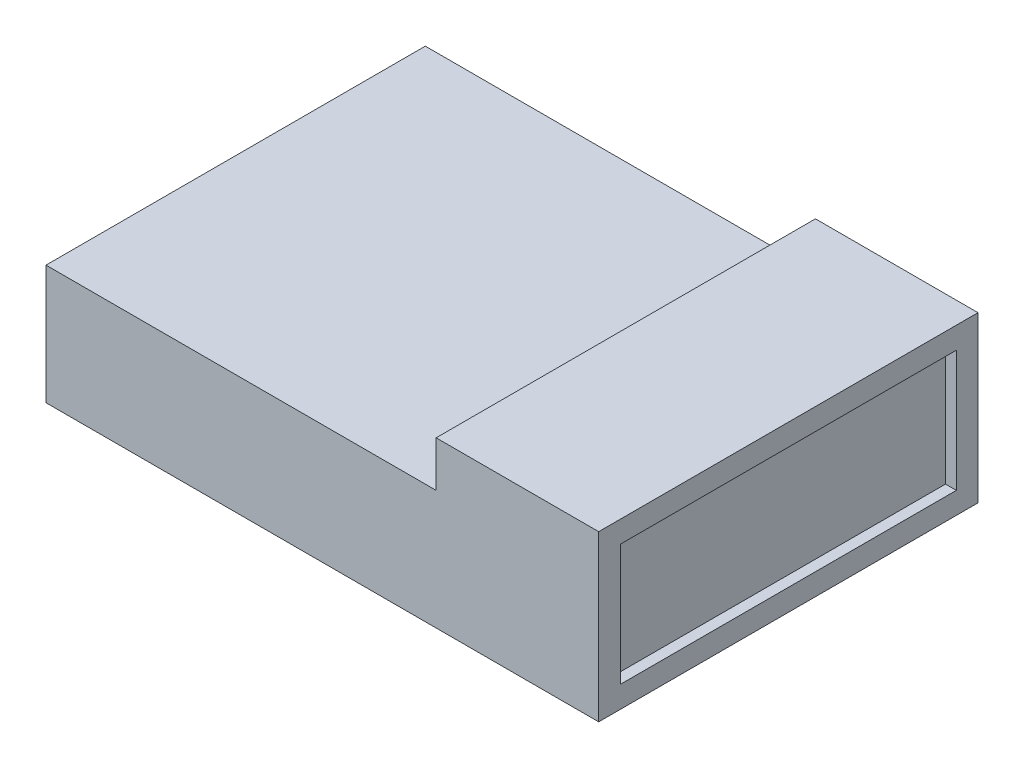
ISO-10303-21;
HEADER;
FILE_DESCRIPTION(('STEP AP214'),'2;1');
FILE_NAME('part.step','',(''),(''),'','','');
FILE_SCHEMA(('AUTOMOTIVE_DESIGN { 1 0 10303 214 1 1 1 1 }'));
ENDSEC;
DATA;
#1=APPLICATION_CONTEXT('core data for automotive mechanical design processes');
#2=APPLICATION_PROTOCOL_DEFINITION('international standard','automotive_design',2000,#1);
#3=PRODUCT_CONTEXT('',#1,'mechanical');
#4=PRODUCT('Part','Part','',(#3));
#5=PRODUCT_RELATED_PRODUCT_CATEGORY('part','',(#4));
#6=PRODUCT_DEFINITION_FORMATION('','',#4);
#7=PRODUCT_DEFINITION_CONTEXT('part definition',#1,'design');
#8=PRODUCT_DEFINITION('design','',#6,#7);
#9=PRODUCT_DEFINITION_SHAPE('','',#8);
#10=(LENGTH_UNIT() NAMED_UNIT(*) SI_UNIT(.MILLI.,.METRE.));
#11=(NAMED_UNIT(*) PLANE_ANGLE_UNIT() SI_UNIT($,.RADIAN.));
#12=(NAMED_UNIT(*) SI_UNIT($,.STERADIAN.) SOLID_ANGLE_UNIT());
#13=UNCERTAINTY_MEASURE_WITH_UNIT(LENGTH_MEASURE(1.E-05),#10,'distance_accuracy_value','');
#14=(GEOMETRIC_REPRESENTATION_CONTEXT(3) GLOBAL_UNCERTAINTY_ASSIGNED_CONTEXT((#13)) GLOBAL_UNIT_ASSIGNED_CONTEXT((#10,
#11,#12)) REPRESENTATION_CONTEXT('',''));
#15=CARTESIAN_POINT('',(0.,0.,0.));
#16=DIRECTION('',(0.,0.,1.));
#17=DIRECTION('',(1.,0.,0.));
#18=AXIS2_PLACEMENT_3D('',#15,#16,#17);
#19=CARTESIAN_POINT('',(0.,11.,-17.5));
#20=DIRECTION('',(0.,0.,-1.));
#21=DIRECTION('',(-1.,0.,0.));
#22=AXIS2_PLACEMENT_3D('',#19,#20,#21);
#23=PLANE('',#22);
#24=DIRECTION('',(1.,0.,0.));
#25=VECTOR('',#24,1.);
#26=CARTESIAN_POINT('',(0.,0.,-17.5));
#27=LINE('',#26,#25);
#28=CARTESIAN_POINT('',(-25.5,0.,-17.5));
#29=VERTEX_POINT('',#28);
#30=CARTESIAN_POINT('',(25.5,0.,-17.5));
#31=VERTEX_POINT('',#30);
#32=EDGE_CURVE('E215',#29,#31,#27,.T.);
#33=ORIENTED_EDGE('',*,*,#32,.F.);
#34=DIRECTION('',(0.,-1.,0.));
#35=VECTOR('',#34,1.);
#36=CARTESIAN_POINT('',(-25.5,11.,-17.5));
#37=LINE('',#36,#35);
#38=CARTESIAN_POINT('',(-25.5,11.,-17.5));
#39=VERTEX_POINT('',#38);
#40=EDGE_CURVE('E11',#39,#29,#37,.T.);
#41=ORIENTED_EDGE('',*,*,#40,.F.);
#42=DIRECTION('',(1.,0.,0.));
#43=VECTOR('',#42,1.);
#44=CARTESIAN_POINT('',(0.,11.,-17.5));
#45=LINE('',#44,#43);
#46=CARTESIAN_POINT('',(10.5,11.,-17.5));
#47=VERTEX_POINT('',#46);
#48=EDGE_CURVE('E218',#39,#47,#45,.T.);
#49=ORIENTED_EDGE('',*,*,#48,.T.);
#50=DIRECTION('',(0.,-1.,0.));
#51=VECTOR('',#50,1.);
#52=CARTESIAN_POINT('',(10.5,15.2,-17.5));
#53=LINE('',#52,#51);
#54=CARTESIAN_POINT('',(10.5,15.2,-17.5));
#55=VERTEX_POINT('',#54);
#56=EDGE_CURVE('E211',#55,#47,#53,.T.);
#57=ORIENTED_EDGE('',*,*,#56,.F.);
#58=DIRECTION('',(1.,0.,0.));
#59=VECTOR('',#58,1.);
#60=CARTESIAN_POINT('',(0.,15.2,-17.5));
#61=LINE('',#60,#59);
#62=CARTESIAN_POINT('',(25.5,15.2,-17.5));
#63=VERTEX_POINT('',#62);
#64=EDGE_CURVE('E182',#55,#63,#61,.T.);
#65=ORIENTED_EDGE('',*,*,#64,.T.);
#66=DIRECTION('',(0.,-1.,0.));
#67=VECTOR('',#66,1.);
#68=CARTESIAN_POINT('',(25.5,15.2,-17.5));
#69=LINE('',#68,#67);
#70=EDGE_CURVE('E196',#63,#31,#69,.T.);
#71=ORIENTED_EDGE('',*,*,#70,.T.);
#72=EDGE_LOOP('',(#33,#41,#49,#57,#65,#71));
#73=FACE_BOUND('',#72,.T.);
#74=ADVANCED_FACE('F47',(#73),#23,.T.);
#75=CARTESIAN_POINT('',(-25.5,11.,0.));
#76=DIRECTION('',(1.,0.,0.));
#77=DIRECTION('',(0.,0.,-1.));
#78=AXIS2_PLACEMENT_3D('',#75,#76,#77);
#79=PLANE('',#78);
#80=DIRECTION('',(0.,0.,1.));
#81=VECTOR('',#80,1.);
#82=CARTESIAN_POINT('',(-25.5,0.,0.));
#83=LINE('',#82,#81);
#84=CARTESIAN_POINT('',(-25.5,0.,17.5));
#85=VERTEX_POINT('',#84);
#86=EDGE_CURVE('E84',#29,#85,#83,.T.);
#87=ORIENTED_EDGE('',*,*,#86,.T.);
#88=DIRECTION('',(0.,-1.,0.));
#89=VECTOR('',#88,1.);
#90=CARTESIAN_POINT('',(-25.5,11.,17.5));
#91=LINE('',#90,#89);
#92=CARTESIAN_POINT('',(-25.5,11.,17.5));
#93=VERTEX_POINT('',#92);
#94=EDGE_CURVE('E55',#93,#85,#91,.T.);
#95=ORIENTED_EDGE('',*,*,#94,.F.);
#96=DIRECTION('',(0.,0.,1.));
#97=VECTOR('',#96,1.);
#98=CARTESIAN_POINT('',(-25.5,11.,0.));
#99=LINE('',#98,#97);
#100=EDGE_CURVE('E71',#39,#93,#99,.T.);
#101=ORIENTED_EDGE('',*,*,#100,.F.);
#102=ORIENTED_EDGE('',*,*,#40,.T.);
#103=EDGE_LOOP('',(#87,#95,#101,#102));
#104=FACE_BOUND('',#103,.T.);
#105=ADVANCED_FACE('F262',(#104),#79,.F.);
#106=CARTESIAN_POINT('',(0.,11.,17.5));
#107=DIRECTION('',(0.,0.,-1.));
#108=DIRECTION('',(-1.,0.,0.));
#109=AXIS2_PLACEMENT_3D('',#106,#107,#108);
#110=PLANE('',#109);
#111=DIRECTION('',(1.,0.,0.));
#112=VECTOR('',#111,1.);
#113=CARTESIAN_POINT('',(0.,0.,17.5));
#114=LINE('',#113,#112);
#115=CARTESIAN_POINT('',(25.5,0.,17.5));
#116=VERTEX_POINT('',#115);
#117=EDGE_CURVE('E219',#85,#116,#114,.T.);
#118=ORIENTED_EDGE('',*,*,#117,.T.);
#119=DIRECTION('',(0.,-1.,0.));
#120=VECTOR('',#119,1.);
#121=CARTESIAN_POINT('',(25.5,15.2,17.5));
#122=LINE('',#121,#120);
#123=CARTESIAN_POINT('',(25.5,15.2,17.5));
#124=VERTEX_POINT('',#123);
#125=EDGE_CURVE('E203',#124,#116,#122,.T.);
#126=ORIENTED_EDGE('',*,*,#125,.F.);
#127=DIRECTION('',(1.,0.,0.));
#128=VECTOR('',#127,1.);
#129=CARTESIAN_POINT('',(0.,15.2,17.5));
#130=LINE('',#129,#128);
#131=CARTESIAN_POINT('',(10.5,15.2,17.5));
#132=VERTEX_POINT('',#131);
#133=EDGE_CURVE('E189',#132,#124,#130,.T.);
#134=ORIENTED_EDGE('',*,*,#133,.F.);
#135=DIRECTION('',(0.,-1.,0.));
#136=VECTOR('',#135,1.);
#137=CARTESIAN_POINT('',(10.5,15.2,17.5));
#138=LINE('',#137,#136);
#139=CARTESIAN_POINT('',(10.5,11.,17.5));
#140=VERTEX_POINT('',#139);
#141=EDGE_CURVE('E207',#132,#140,#138,.T.);
#142=ORIENTED_EDGE('',*,*,#141,.T.);
#143=DIRECTION('',(1.,0.,0.));
#144=VECTOR('',#143,1.);
#145=CARTESIAN_POINT('',(0.,11.,17.5));
#146=LINE('',#145,#144);
#147=EDGE_CURVE('E224',#93,#140,#146,.T.);
#148=ORIENTED_EDGE('',*,*,#147,.F.);
#149=ORIENTED_EDGE('',*,*,#94,.T.);
#150=EDGE_LOOP('',(#118,#126,#134,#142,#148,#149));
#151=FACE_BOUND('',#150,.T.);
#152=ADVANCED_FACE('F236',(#151),#110,.F.);
#153=CARTESIAN_POINT('',(0.,11.,0.));
#154=DIRECTION('',(0.,1.,0.));
#155=DIRECTION('',(0.,0.,1.));
#156=AXIS2_PLACEMENT_3D('',#153,#154,#155);
#157=PLANE('',#156);
#158=DIRECTION('',(0.,0.,1.));
#159=VECTOR('',#158,1.);
#160=CARTESIAN_POINT('',(10.5,11.,0.));
#161=LINE('',#160,#159);
#162=EDGE_CURVE('E88',#47,#140,#161,.T.);
#163=ORIENTED_EDGE('',*,*,#162,.F.);
#164=ORIENTED_EDGE('',*,*,#48,.F.);
#165=ORIENTED_EDGE('',*,*,#100,.T.);
#166=ORIENTED_EDGE('',*,*,#147,.T.);
#167=EDGE_LOOP('',(#163,#164,#165,#166));
#168=FACE_BOUND('',#167,.T.);
#169=ADVANCED_FACE('F254',(#168),#157,.T.);
#170=CARTESIAN_POINT('',(0.,0.,0.));
#171=DIRECTION('',(0.,1.,0.));
#172=DIRECTION('',(0.,0.,1.));
#173=AXIS2_PLACEMENT_3D('',#170,#171,#172);
#174=PLANE('',#173);
#175=ORIENTED_EDGE('',*,*,#32,.T.);
#176=DIRECTION('',(0.,0.,1.));
#177=VECTOR('',#176,1.);
#178=CARTESIAN_POINT('',(25.5,0.,0.));
#179=LINE('',#178,#177);
#180=EDGE_CURVE('E176',#31,#116,#179,.T.);
#181=ORIENTED_EDGE('',*,*,#180,.T.);
#182=ORIENTED_EDGE('',*,*,#117,.F.);
#183=ORIENTED_EDGE('',*,*,#86,.F.);
#184=EDGE_LOOP('',(#175,#181,#182,#183));
#185=FACE_BOUND('',#184,.T.);
#186=ADVANCED_FACE('F239',(#185),#174,.F.);
#187=CARTESIAN_POINT('',(10.5,15.2,0.));
#188=DIRECTION('',(1.,0.,0.));
#189=DIRECTION('',(0.,0.,-1.));
#190=AXIS2_PLACEMENT_3D('',#187,#188,#189);
#191=PLANE('',#190);
#192=ORIENTED_EDGE('',*,*,#56,.T.);
#193=ORIENTED_EDGE('',*,*,#162,.T.);
#194=ORIENTED_EDGE('',*,*,#141,.F.);
#195=DIRECTION('',(0.,0.,1.));
#196=VECTOR('',#195,1.);
#197=CARTESIAN_POINT('',(10.5,15.2,0.));
#198=LINE('',#197,#196);
#199=EDGE_CURVE('E186',#55,#132,#198,.T.);
#200=ORIENTED_EDGE('',*,*,#199,.F.);
#201=EDGE_LOOP('',(#192,#193,#194,#200));
#202=FACE_BOUND('',#201,.T.);
#203=ADVANCED_FACE('F252',(#202),#191,.F.);
#204=CARTESIAN_POINT('',(25.5,15.2,0.));
#205=DIRECTION('',(1.,0.,0.));
#206=DIRECTION('',(0.,0.,-1.));
#207=AXIS2_PLACEMENT_3D('',#204,#205,#206);
#208=PLANE('',#207);
#209=DIRECTION('',(0.,-1.,0.));
#210=VECTOR('',#209,1.);
#211=CARTESIAN_POINT('',(25.5,13.2,15.5));
#212=LINE('',#211,#210);
#213=CARTESIAN_POINT('',(25.5,13.2,15.5));
#214=VERTEX_POINT('',#213);
#215=CARTESIAN_POINT('',(25.5,2.,15.5));
#216=VERTEX_POINT('',#215);
#217=EDGE_CURVE('E62',#214,#216,#212,.T.);
#218=ORIENTED_EDGE('',*,*,#217,.F.);
#219=DIRECTION('',(0.,0.,1.));
#220=VECTOR('',#219,1.);
#221=CARTESIAN_POINT('',(25.5,13.2,15.5));
#222=LINE('',#221,#220);
#223=CARTESIAN_POINT('',(25.5,13.2,-15.5));
#224=VERTEX_POINT('',#223);
#225=EDGE_CURVE('E154',#224,#214,#222,.T.);
#226=ORIENTED_EDGE('',*,*,#225,.F.);
#227=DIRECTION('',(0.,1.,0.));
#228=VECTOR('',#227,1.);
#229=CARTESIAN_POINT('',(25.5,13.2,-15.5));
#230=LINE('',#229,#228);
#231=CARTESIAN_POINT('',(25.5,2.,-15.5));
#232=VERTEX_POINT('',#231);
#233=EDGE_CURVE('E158',#232,#224,#230,.T.);
#234=ORIENTED_EDGE('',*,*,#233,.F.);
#235=DIRECTION('',(0.,0.,-1.));
#236=VECTOR('',#235,1.);
#237=CARTESIAN_POINT('',(25.5,2.,15.5));
#238=LINE('',#237,#236);
#239=EDGE_CURVE('E167',#216,#232,#238,.T.);
#240=ORIENTED_EDGE('',*,*,#239,.F.);
#241=EDGE_LOOP('',(#218,#226,#234,#240));
#242=FACE_BOUND('',#241,.T.);
#243=ORIENTED_EDGE('',*,*,#180,.F.);
#244=ORIENTED_EDGE('',*,*,#70,.F.);
#245=DIRECTION('',(0.,0.,1.));
#246=VECTOR('',#245,1.);
#247=CARTESIAN_POINT('',(25.5,15.2,0.));
#248=LINE('',#247,#246);
#249=EDGE_CURVE('E192',#63,#124,#248,.T.);
#250=ORIENTED_EDGE('',*,*,#249,.T.);
#251=ORIENTED_EDGE('',*,*,#125,.T.);
#252=EDGE_LOOP('',(#243,#244,#250,#251));
#253=FACE_BOUND('',#252,.T.);
#254=ADVANCED_FACE('F243',(#242,#253),#208,.T.);
#255=CARTESIAN_POINT('',(0.,15.2,0.));
#256=DIRECTION('',(0.,1.,0.));
#257=DIRECTION('',(0.,0.,1.));
#258=AXIS2_PLACEMENT_3D('',#255,#256,#257);
#259=PLANE('',#258);
#260=ORIENTED_EDGE('',*,*,#64,.F.);
#261=ORIENTED_EDGE('',*,*,#199,.T.);
#262=ORIENTED_EDGE('',*,*,#133,.T.);
#263=ORIENTED_EDGE('',*,*,#249,.F.);
#264=EDGE_LOOP('',(#260,#261,#262,#263));
#265=FACE_BOUND('',#264,.T.);
#266=ADVANCED_FACE('F249',(#265),#259,.T.);
#267=CARTESIAN_POINT('',(24.5,13.2,15.5));
#268=DIRECTION('',(0.,0.,1.));
#269=DIRECTION('',(0.,-1.,0.));
#270=AXIS2_PLACEMENT_3D('',#267,#268,#269);
#271=PLANE('',#270);
#272=ORIENTED_EDGE('',*,*,#217,.T.);
#273=DIRECTION('',(1.,0.,0.));
#274=VECTOR('',#273,1.);
#275=CARTESIAN_POINT('',(24.5,2.,15.5));
#276=LINE('',#275,#274);
#277=CARTESIAN_POINT('',(24.5,2.,15.5));
#278=VERTEX_POINT('',#277);
#279=EDGE_CURVE('E129',#278,#216,#276,.T.);
#280=ORIENTED_EDGE('',*,*,#279,.F.);
#281=DIRECTION('',(0.,-1.,0.));
#282=VECTOR('',#281,1.);
#283=CARTESIAN_POINT('',(24.5,13.2,15.5));
#284=LINE('',#283,#282);
#285=CARTESIAN_POINT('',(24.5,13.2,15.5));
#286=VERTEX_POINT('',#285);
#287=EDGE_CURVE('E133',#286,#278,#284,.T.);
#288=ORIENTED_EDGE('',*,*,#287,.F.);
#289=DIRECTION('',(1.,0.,0.));
#290=VECTOR('',#289,1.);
#291=CARTESIAN_POINT('',(24.5,13.2,15.5));
#292=LINE('',#291,#290);
#293=EDGE_CURVE('E173',#286,#214,#292,.T.);
#294=ORIENTED_EDGE('',*,*,#293,.T.);
#295=EDGE_LOOP('',(#272,#280,#288,#294));
#296=FACE_BOUND('',#295,.T.);
#297=ADVANCED_FACE('F131',(#296),#271,.F.);
#298=CARTESIAN_POINT('',(24.5,13.2,15.5));
#299=DIRECTION('',(0.,1.,0.));
#300=DIRECTION('',(0.,0.,1.));
#301=AXIS2_PLACEMENT_3D('',#298,#299,#300);
#302=PLANE('',#301);
#303=ORIENTED_EDGE('',*,*,#225,.T.);
#304=ORIENTED_EDGE('',*,*,#293,.F.);
#305=DIRECTION('',(0.,0.,1.));
#306=VECTOR('',#305,1.);
#307=CARTESIAN_POINT('',(24.5,13.2,15.5));
#308=LINE('',#307,#306);
#309=CARTESIAN_POINT('',(24.5,13.2,-15.5));
#310=VERTEX_POINT('',#309);
#311=EDGE_CURVE('E140',#310,#286,#308,.T.);
#312=ORIENTED_EDGE('',*,*,#311,.F.);
#313=DIRECTION('',(1.,0.,0.));
#314=VECTOR('',#313,1.);
#315=CARTESIAN_POINT('',(24.5,13.2,-15.5));
#316=LINE('',#315,#314);
#317=EDGE_CURVE('E177',#310,#224,#316,.T.);
#318=ORIENTED_EDGE('',*,*,#317,.T.);
#319=EDGE_LOOP('',(#303,#304,#312,#318));
#320=FACE_BOUND('',#319,.T.);
#321=ADVANCED_FACE('F341',(#320),#302,.F.);
#322=CARTESIAN_POINT('',(24.5,13.2,-15.5));
#323=DIRECTION('',(0.,0.,-1.));
#324=DIRECTION('',(0.,1.,0.));
#325=AXIS2_PLACEMENT_3D('',#322,#323,#324);
#326=PLANE('',#325);
#327=ORIENTED_EDGE('',*,*,#233,.T.);
#328=ORIENTED_EDGE('',*,*,#317,.F.);
#329=DIRECTION('',(0.,1.,0.));
#330=VECTOR('',#329,1.);
#331=CARTESIAN_POINT('',(24.5,13.2,-15.5));
#332=LINE('',#331,#330);
#333=CARTESIAN_POINT('',(24.5,2.,-15.5));
#334=VERTEX_POINT('',#333);
#335=EDGE_CURVE('E149',#334,#310,#332,.T.);
#336=ORIENTED_EDGE('',*,*,#335,.F.);
#337=DIRECTION('',(1.,0.,0.));
#338=VECTOR('',#337,1.);
#339=CARTESIAN_POINT('',(24.5,2.,-15.5));
#340=LINE('',#339,#338);
#341=EDGE_CURVE('E139',#334,#232,#340,.T.);
#342=ORIENTED_EDGE('',*,*,#341,.T.);
#343=EDGE_LOOP('',(#327,#328,#336,#342));
#344=FACE_BOUND('',#343,.T.);
#345=ADVANCED_FACE('F350',(#344),#326,.F.);
#346=CARTESIAN_POINT('',(24.5,2.,15.5));
#347=DIRECTION('',(0.,-1.,0.));
#348=DIRECTION('',(0.,0.,-1.));
#349=AXIS2_PLACEMENT_3D('',#346,#347,#348);
#350=PLANE('',#349);
#351=ORIENTED_EDGE('',*,*,#239,.T.);
#352=ORIENTED_EDGE('',*,*,#341,.F.);
#353=DIRECTION('',(0.,0.,-1.));
#354=VECTOR('',#353,1.);
#355=CARTESIAN_POINT('',(24.5,2.,15.5));
#356=LINE('',#355,#354);
#357=EDGE_CURVE('E143',#278,#334,#356,.T.);
#358=ORIENTED_EDGE('',*,*,#357,.F.);
#359=ORIENTED_EDGE('',*,*,#279,.T.);
#360=EDGE_LOOP('',(#351,#352,#358,#359));
#361=FACE_BOUND('',#360,.T.);
#362=ADVANCED_FACE('F144',(#361),#350,.F.);
#363=CARTESIAN_POINT('',(24.5,0.,0.));
#364=DIRECTION('',(1.,0.,0.));
#365=DIRECTION('',(0.,0.,-1.));
#366=AXIS2_PLACEMENT_3D('',#363,#364,#365);
#367=PLANE('',#366);
#368=ORIENTED_EDGE('',*,*,#287,.T.);
#369=ORIENTED_EDGE('',*,*,#357,.T.);
#370=ORIENTED_EDGE('',*,*,#335,.T.);
#371=ORIENTED_EDGE('',*,*,#311,.T.);
#372=EDGE_LOOP('',(#368,#369,#370,#371));
#373=FACE_BOUND('',#372,.T.);
#374=ADVANCED_FACE('F151',(#373),#367,.T.);
#375=CLOSED_SHELL('',(#74,#105,#152,#169,#186,#203,#254,#266,#297,#321,#345,#362,#374));
#376=MANIFOLD_SOLID_BREP('B2',#375);
#377=ADVANCED_BREP_SHAPE_REPRESENTATION('',(#18,#376),#14);
#378=SHAPE_DEFINITION_REPRESENTATION(#9,#377);
ENDSEC;
END-ISO-10303-21;
